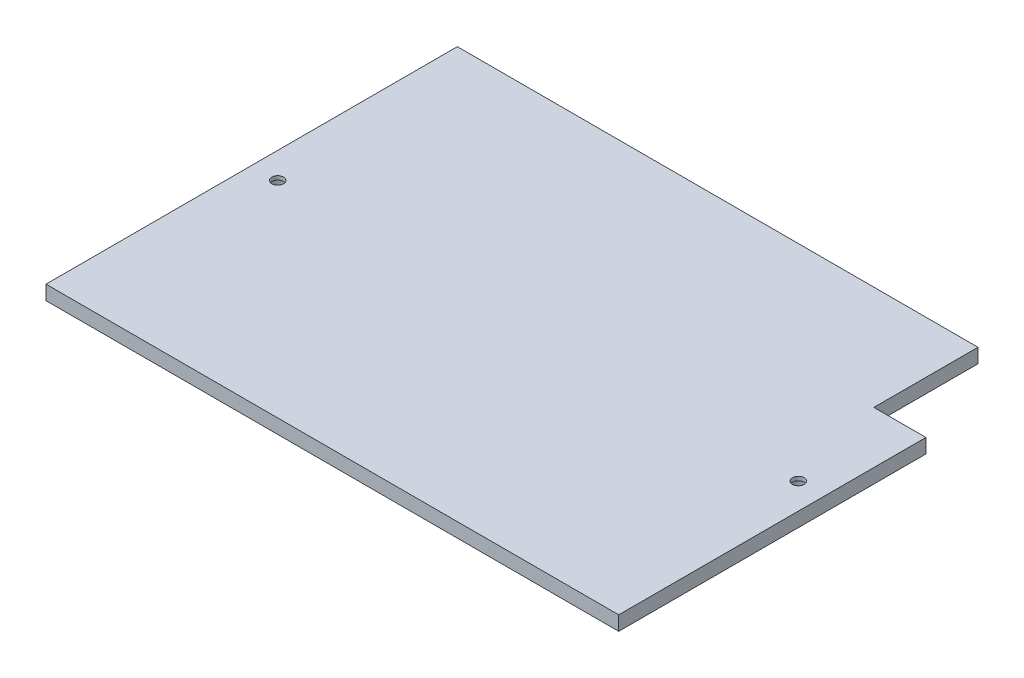
ISO-10303-21;
HEADER;
FILE_DESCRIPTION(('STEP AP214'),'2;1');
FILE_NAME('part.step','',(''),(''),'','','');
FILE_SCHEMA(('AUTOMOTIVE_DESIGN { 1 0 10303 214 1 1 1 1 }'));
ENDSEC;
DATA;
#1=APPLICATION_CONTEXT('core data for automotive mechanical design processes');
#2=APPLICATION_PROTOCOL_DEFINITION('international standard','automotive_design',2000,#1);
#3=PRODUCT_CONTEXT('',#1,'mechanical');
#4=PRODUCT('Part','Part','',(#3));
#5=PRODUCT_RELATED_PRODUCT_CATEGORY('part','',(#4));
#6=PRODUCT_DEFINITION_FORMATION('','',#4);
#7=PRODUCT_DEFINITION_CONTEXT('part definition',#1,'design');
#8=PRODUCT_DEFINITION('design','',#6,#7);
#9=PRODUCT_DEFINITION_SHAPE('','',#8);
#10=(LENGTH_UNIT() NAMED_UNIT(*) SI_UNIT(.MILLI.,.METRE.));
#11=(NAMED_UNIT(*) PLANE_ANGLE_UNIT() SI_UNIT($,.RADIAN.));
#12=(NAMED_UNIT(*) SI_UNIT($,.STERADIAN.) SOLID_ANGLE_UNIT());
#13=UNCERTAINTY_MEASURE_WITH_UNIT(LENGTH_MEASURE(1.E-05),#10,'distance_accuracy_value','');
#14=(GEOMETRIC_REPRESENTATION_CONTEXT(3) GLOBAL_UNCERTAINTY_ASSIGNED_CONTEXT((#13)) GLOBAL_UNIT_ASSIGNED_CONTEXT((#10,
#11,#12)) REPRESENTATION_CONTEXT('',''));
#15=CARTESIAN_POINT('',(0.,0.,0.));
#16=DIRECTION('',(0.,0.,1.));
#17=DIRECTION('',(1.,0.,0.));
#18=AXIS2_PLACEMENT_3D('',#15,#16,#17);
#19=CARTESIAN_POINT('',(110.,5.5,-79.));
#20=DIRECTION('',(-1.,0.,0.));
#21=DIRECTION('',(0.,0.,1.));
#22=AXIS2_PLACEMENT_3D('',#19,#20,#21);
#23=PLANE('',#22);
#24=DIRECTION('',(0.,0.,-1.));
#25=VECTOR('',#24,1.);
#26=CARTESIAN_POINT('',(110.,0.,-79.));
#27=LINE('',#26,#25);
#28=CARTESIAN_POINT('',(110.,0.,79.));
#29=VERTEX_POINT('',#28);
#30=CARTESIAN_POINT('',(110.,0.,-39.));
#31=VERTEX_POINT('',#30);
#32=EDGE_CURVE('E117',#29,#31,#27,.T.);
#33=ORIENTED_EDGE('',*,*,#32,.T.);
#34=DIRECTION('',(0.,1.,0.));
#35=VECTOR('',#34,1.);
#36=CARTESIAN_POINT('',(110.,0.,-39.));
#37=LINE('',#36,#35);
#38=CARTESIAN_POINT('',(110.,5.5,-39.));
#39=VERTEX_POINT('',#38);
#40=EDGE_CURVE('E136',#31,#39,#37,.T.);
#41=ORIENTED_EDGE('',*,*,#40,.T.);
#42=DIRECTION('',(0.,0.,-1.));
#43=VECTOR('',#42,1.);
#44=CARTESIAN_POINT('',(110.,5.5,-79.));
#45=LINE('',#44,#43);
#46=CARTESIAN_POINT('',(110.,5.5,79.));
#47=VERTEX_POINT('',#46);
#48=EDGE_CURVE('E126',#47,#39,#45,.T.);
#49=ORIENTED_EDGE('',*,*,#48,.F.);
#50=DIRECTION('',(0.,-1.,0.));
#51=VECTOR('',#50,1.);
#52=CARTESIAN_POINT('',(110.,5.5,79.));
#53=LINE('',#52,#51);
#54=EDGE_CURVE('E127',#47,#29,#53,.T.);
#55=ORIENTED_EDGE('',*,*,#54,.T.);
#56=EDGE_LOOP('',(#33,#41,#49,#55));
#57=FACE_BOUND('',#56,.T.);
#58=ADVANCED_FACE('F39',(#57),#23,.F.);
#59=CARTESIAN_POINT('',(-110.,5.5,-79.));
#60=DIRECTION('',(0.,0.,1.));
#61=DIRECTION('',(1.,0.,0.));
#62=AXIS2_PLACEMENT_3D('',#59,#60,#61);
#63=PLANE('',#62);
#64=DIRECTION('',(-1.,0.,0.));
#65=VECTOR('',#64,1.);
#66=CARTESIAN_POINT('',(-110.,5.5,-79.));
#67=LINE('',#66,#65);
#68=CARTESIAN_POINT('',(90.,5.5,-79.));
#69=VERTEX_POINT('',#68);
#70=CARTESIAN_POINT('',(-110.,5.5,-79.));
#71=VERTEX_POINT('',#70);
#72=EDGE_CURVE('E84',#69,#71,#67,.T.);
#73=ORIENTED_EDGE('',*,*,#72,.F.);
#74=DIRECTION('',(0.,1.,0.));
#75=VECTOR('',#74,1.);
#76=CARTESIAN_POINT('',(90.,0.,-79.));
#77=LINE('',#76,#75);
#78=CARTESIAN_POINT('',(90.,0.,-79.));
#79=VERTEX_POINT('',#78);
#80=EDGE_CURVE('E104',#79,#69,#77,.T.);
#81=ORIENTED_EDGE('',*,*,#80,.F.);
#82=DIRECTION('',(-1.,0.,0.));
#83=VECTOR('',#82,1.);
#84=CARTESIAN_POINT('',(-110.,0.,-79.));
#85=LINE('',#84,#83);
#86=CARTESIAN_POINT('',(-110.,0.,-79.));
#87=VERTEX_POINT('',#86);
#88=EDGE_CURVE('E112',#79,#87,#85,.T.);
#89=ORIENTED_EDGE('',*,*,#88,.T.);
#90=DIRECTION('',(0.,-1.,0.));
#91=VECTOR('',#90,1.);
#92=CARTESIAN_POINT('',(-110.,5.5,-79.));
#93=LINE('',#92,#91);
#94=EDGE_CURVE('E11',#71,#87,#93,.T.);
#95=ORIENTED_EDGE('',*,*,#94,.F.);
#96=EDGE_LOOP('',(#73,#81,#89,#95));
#97=FACE_BOUND('',#96,.T.);
#98=ADVANCED_FACE('F111',(#97),#63,.F.);
#99=CARTESIAN_POINT('',(-110.,5.5,-79.));
#100=DIRECTION('',(1.,0.,0.));
#101=DIRECTION('',(0.,0.,-1.));
#102=AXIS2_PLACEMENT_3D('',#99,#100,#101);
#103=PLANE('',#102);
#104=DIRECTION('',(0.,0.,1.));
#105=VECTOR('',#104,1.);
#106=CARTESIAN_POINT('',(-110.,0.,-79.));
#107=LINE('',#106,#105);
#108=CARTESIAN_POINT('',(-110.,0.,79.));
#109=VERTEX_POINT('',#108);
#110=EDGE_CURVE('E116',#87,#109,#107,.T.);
#111=ORIENTED_EDGE('',*,*,#110,.T.);
#112=DIRECTION('',(0.,-1.,0.));
#113=VECTOR('',#112,1.);
#114=CARTESIAN_POINT('',(-110.,5.5,79.));
#115=LINE('',#114,#113);
#116=CARTESIAN_POINT('',(-110.,5.5,79.));
#117=VERTEX_POINT('',#116);
#118=EDGE_CURVE('E46',#117,#109,#115,.T.);
#119=ORIENTED_EDGE('',*,*,#118,.F.);
#120=DIRECTION('',(0.,0.,1.));
#121=VECTOR('',#120,1.);
#122=CARTESIAN_POINT('',(-110.,5.5,-79.));
#123=LINE('',#122,#121);
#124=EDGE_CURVE('E139',#71,#117,#123,.T.);
#125=ORIENTED_EDGE('',*,*,#124,.F.);
#126=ORIENTED_EDGE('',*,*,#94,.T.);
#127=EDGE_LOOP('',(#111,#119,#125,#126));
#128=FACE_BOUND('',#127,.T.);
#129=ADVANCED_FACE('F146',(#128),#103,.F.);
#130=CARTESIAN_POINT('',(-110.,5.5,79.));
#131=DIRECTION('',(0.,0.,-1.));
#132=DIRECTION('',(-1.,0.,0.));
#133=AXIS2_PLACEMENT_3D('',#130,#131,#132);
#134=PLANE('',#133);
#135=DIRECTION('',(1.,0.,0.));
#136=VECTOR('',#135,1.);
#137=CARTESIAN_POINT('',(-110.,0.,79.));
#138=LINE('',#137,#136);
#139=EDGE_CURVE('E79',#109,#29,#138,.T.);
#140=ORIENTED_EDGE('',*,*,#139,.T.);
#141=ORIENTED_EDGE('',*,*,#54,.F.);
#142=DIRECTION('',(1.,0.,0.));
#143=VECTOR('',#142,1.);
#144=CARTESIAN_POINT('',(-110.,5.5,79.));
#145=LINE('',#144,#143);
#146=EDGE_CURVE('E62',#117,#47,#145,.T.);
#147=ORIENTED_EDGE('',*,*,#146,.F.);
#148=ORIENTED_EDGE('',*,*,#118,.T.);
#149=EDGE_LOOP('',(#140,#141,#147,#148));
#150=FACE_BOUND('',#149,.T.);
#151=ADVANCED_FACE('F129',(#150),#134,.F.);
#152=CARTESIAN_POINT('',(0.,5.5,0.));
#153=DIRECTION('',(0.,1.,0.));
#154=DIRECTION('',(0.,0.,1.));
#155=AXIS2_PLACEMENT_3D('',#152,#153,#154);
#156=PLANE('',#155);
#157=DIRECTION('',(1.,0.,0.));
#158=VECTOR('',#157,1.);
#159=CARTESIAN_POINT('',(110.,5.5,-39.));
#160=LINE('',#159,#158);
#161=CARTESIAN_POINT('',(90.,5.5,-39.));
#162=VERTEX_POINT('',#161);
#163=EDGE_CURVE('E108',#162,#39,#160,.T.);
#164=ORIENTED_EDGE('',*,*,#163,.F.);
#165=DIRECTION('',(0.,0.,1.));
#166=VECTOR('',#165,1.);
#167=CARTESIAN_POINT('',(90.,5.5,-79.));
#168=LINE('',#167,#166);
#169=EDGE_CURVE('E299',#69,#162,#168,.T.);
#170=ORIENTED_EDGE('',*,*,#169,.F.);
#171=ORIENTED_EDGE('',*,*,#72,.T.);
#172=ORIENTED_EDGE('',*,*,#124,.T.);
#173=ORIENTED_EDGE('',*,*,#146,.T.);
#174=ORIENTED_EDGE('',*,*,#48,.T.);
#175=EDGE_LOOP('',(#164,#170,#171,#172,#173,#174));
#176=FACE_BOUND('',#175,.T.);
#177=CARTESIAN_POINT('',(-100.,5.5,0.));
#178=DIRECTION('',(0.,-1.,0.));
#179=DIRECTION('',(0.,0.,-1.));
#180=AXIS2_PLACEMENT_3D('',#177,#178,#179);
#181=CIRCLE('',#180,2.25);
#182=CARTESIAN_POINT('',(-100.,5.5,-2.25));
#183=VERTEX_POINT('',#182);
#184=EDGE_CURVE('E284',#183,#183,#181,.T.);
#185=ORIENTED_EDGE('',*,*,#184,.T.);
#186=EDGE_LOOP('',(#185));
#187=FACE_BOUND('',#186,.T.);
#188=CARTESIAN_POINT('',(100.,5.5,0.));
#189=DIRECTION('',(0.,-1.,0.));
#190=DIRECTION('',(0.,0.,-1.));
#191=AXIS2_PLACEMENT_3D('',#188,#189,#190);
#192=CIRCLE('',#191,2.25);
#193=CARTESIAN_POINT('',(100.,5.5,-2.25));
#194=VERTEX_POINT('',#193);
#195=EDGE_CURVE('E121',#194,#194,#192,.T.);
#196=ORIENTED_EDGE('',*,*,#195,.T.);
#197=EDGE_LOOP('',(#196));
#198=FACE_BOUND('',#197,.T.);
#199=ADVANCED_FACE('F144',(#176,#187,#198),#156,.T.);
#200=CARTESIAN_POINT('',(0.,0.,0.));
#201=DIRECTION('',(0.,1.,0.));
#202=DIRECTION('',(0.,0.,1.));
#203=AXIS2_PLACEMENT_3D('',#200,#201,#202);
#204=PLANE('',#203);
#205=CARTESIAN_POINT('',(-100.,0.,0.));
#206=DIRECTION('',(0.,-1.,0.));
#207=DIRECTION('',(0.,0.,-1.));
#208=AXIS2_PLACEMENT_3D('',#205,#206,#207);
#209=CIRCLE('',#208,3.99999999999999);
#210=CARTESIAN_POINT('',(-100.,0.,-3.99999999999999));
#211=VERTEX_POINT('',#210);
#212=EDGE_CURVE('E293',#211,#211,#209,.T.);
#213=ORIENTED_EDGE('',*,*,#212,.F.);
#214=EDGE_LOOP('',(#213));
#215=FACE_BOUND('',#214,.T.);
#216=CARTESIAN_POINT('',(100.,0.,0.));
#217=DIRECTION('',(0.,-1.,0.));
#218=DIRECTION('',(0.,0.,-1.));
#219=AXIS2_PLACEMENT_3D('',#216,#217,#218);
#220=CIRCLE('',#219,3.99999999999999);
#221=CARTESIAN_POINT('',(100.,0.,-3.99999999999999));
#222=VERTEX_POINT('',#221);
#223=EDGE_CURVE('E279',#222,#222,#220,.T.);
#224=ORIENTED_EDGE('',*,*,#223,.F.);
#225=EDGE_LOOP('',(#224));
#226=FACE_BOUND('',#225,.T.);
#227=DIRECTION('',(0.,0.,1.));
#228=VECTOR('',#227,1.);
#229=CARTESIAN_POINT('',(90.,0.,-79.));
#230=LINE('',#229,#228);
#231=CARTESIAN_POINT('',(90.,0.,-39.));
#232=VERTEX_POINT('',#231);
#233=EDGE_CURVE('E100',#79,#232,#230,.T.);
#234=ORIENTED_EDGE('',*,*,#233,.T.);
#235=DIRECTION('',(1.,0.,0.));
#236=VECTOR('',#235,1.);
#237=CARTESIAN_POINT('',(110.,0.,-39.));
#238=LINE('',#237,#236);
#239=EDGE_CURVE('E53',#232,#31,#238,.T.);
#240=ORIENTED_EDGE('',*,*,#239,.T.);
#241=ORIENTED_EDGE('',*,*,#32,.F.);
#242=ORIENTED_EDGE('',*,*,#139,.F.);
#243=ORIENTED_EDGE('',*,*,#110,.F.);
#244=ORIENTED_EDGE('',*,*,#88,.F.);
#245=EDGE_LOOP('',(#234,#240,#241,#242,#243,#244));
#246=FACE_BOUND('',#245,.T.);
#247=ADVANCED_FACE('F115',(#215,#226,#246),#204,.F.);
#248=CARTESIAN_POINT('',(100.,0.,0.));
#249=DIRECTION('',(0.,-1.,0.));
#250=DIRECTION('',(0.,0.,-1.));
#251=AXIS2_PLACEMENT_3D('',#248,#249,#250);
#252=CYLINDRICAL_SURFACE('',#251,2.25);
#253=ORIENTED_EDGE('',*,*,#195,.F.);
#254=EDGE_LOOP('',(#253));
#255=FACE_BOUND('',#254,.T.);
#256=CARTESIAN_POINT('',(100.,4.,0.));
#257=DIRECTION('',(0.,-1.,0.));
#258=DIRECTION('',(0.,0.,-1.));
#259=AXIS2_PLACEMENT_3D('',#256,#257,#258);
#260=CIRCLE('',#259,2.25);
#261=CARTESIAN_POINT('',(100.,4.,-2.25));
#262=VERTEX_POINT('',#261);
#263=EDGE_CURVE('E276',#262,#262,#260,.T.);
#264=ORIENTED_EDGE('',*,*,#263,.T.);
#265=EDGE_LOOP('',(#264));
#266=FACE_BOUND('',#265,.T.);
#267=ADVANCED_FACE('F182',(#255,#266),#252,.F.);
#268=CARTESIAN_POINT('',(102.25,4.,0.));
#269=DIRECTION('',(0.,1.,0.));
#270=DIRECTION('',(0.,0.,1.));
#271=AXIS2_PLACEMENT_3D('',#268,#269,#270);
#272=PLANE('',#271);
#273=ORIENTED_EDGE('',*,*,#263,.F.);
#274=EDGE_LOOP('',(#273));
#275=FACE_BOUND('',#274,.T.);
#276=CARTESIAN_POINT('',(100.,4.,0.));
#277=DIRECTION('',(0.,-1.,0.));
#278=DIRECTION('',(0.,0.,-1.));
#279=AXIS2_PLACEMENT_3D('',#276,#277,#278);
#280=CIRCLE('',#279,4.);
#281=CARTESIAN_POINT('',(100.,4.,-4.));
#282=VERTEX_POINT('',#281);
#283=EDGE_CURVE('E277',#282,#282,#280,.T.);
#284=ORIENTED_EDGE('',*,*,#283,.T.);
#285=EDGE_LOOP('',(#284));
#286=FACE_BOUND('',#285,.T.);
#287=ADVANCED_FACE('F234',(#275,#286),#272,.F.);
#288=CARTESIAN_POINT('',(100.,0.,0.));
#289=DIRECTION('',(0.,-1.,0.));
#290=DIRECTION('',(0.,0.,-1.));
#291=AXIS2_PLACEMENT_3D('',#288,#289,#290);
#292=CYLINDRICAL_SURFACE('',#291,4.);
#293=ORIENTED_EDGE('',*,*,#283,.F.);
#294=EDGE_LOOP('',(#293));
#295=FACE_BOUND('',#294,.T.);
#296=ORIENTED_EDGE('',*,*,#223,.T.);
#297=EDGE_LOOP('',(#296));
#298=FACE_BOUND('',#297,.T.);
#299=ADVANCED_FACE('F225',(#295,#298),#292,.F.);
#300=CARTESIAN_POINT('',(-100.,0.,0.));
#301=DIRECTION('',(0.,-1.,0.));
#302=DIRECTION('',(0.,0.,-1.));
#303=AXIS2_PLACEMENT_3D('',#300,#301,#302);
#304=CYLINDRICAL_SURFACE('',#303,2.25);
#305=ORIENTED_EDGE('',*,*,#184,.F.);
#306=EDGE_LOOP('',(#305));
#307=FACE_BOUND('',#306,.T.);
#308=CARTESIAN_POINT('',(-100.,4.,0.));
#309=DIRECTION('',(0.,-1.,0.));
#310=DIRECTION('',(0.,0.,-1.));
#311=AXIS2_PLACEMENT_3D('',#308,#309,#310);
#312=CIRCLE('',#311,2.25);
#313=CARTESIAN_POINT('',(-100.,4.,-2.25));
#314=VERTEX_POINT('',#313);
#315=EDGE_CURVE('E287',#314,#314,#312,.T.);
#316=ORIENTED_EDGE('',*,*,#315,.T.);
#317=EDGE_LOOP('',(#316));
#318=FACE_BOUND('',#317,.T.);
#319=ADVANCED_FACE('F216',(#307,#318),#304,.F.);
#320=CARTESIAN_POINT('',(-97.75,4.,0.));
#321=DIRECTION('',(0.,1.,0.));
#322=DIRECTION('',(0.,0.,1.));
#323=AXIS2_PLACEMENT_3D('',#320,#321,#322);
#324=PLANE('',#323);
#325=ORIENTED_EDGE('',*,*,#315,.F.);
#326=EDGE_LOOP('',(#325));
#327=FACE_BOUND('',#326,.T.);
#328=CARTESIAN_POINT('',(-100.,4.,0.));
#329=DIRECTION('',(0.,-1.,0.));
#330=DIRECTION('',(0.,0.,-1.));
#331=AXIS2_PLACEMENT_3D('',#328,#329,#330);
#332=CIRCLE('',#331,4.);
#333=CARTESIAN_POINT('',(-100.,4.,-4.));
#334=VERTEX_POINT('',#333);
#335=EDGE_CURVE('E290',#334,#334,#332,.T.);
#336=ORIENTED_EDGE('',*,*,#335,.T.);
#337=EDGE_LOOP('',(#336));
#338=FACE_BOUND('',#337,.T.);
#339=ADVANCED_FACE('F208',(#327,#338),#324,.F.);
#340=CARTESIAN_POINT('',(-100.,0.,0.));
#341=DIRECTION('',(0.,-1.,0.));
#342=DIRECTION('',(0.,0.,-1.));
#343=AXIS2_PLACEMENT_3D('',#340,#341,#342);
#344=CYLINDRICAL_SURFACE('',#343,4.);
#345=ORIENTED_EDGE('',*,*,#335,.F.);
#346=EDGE_LOOP('',(#345));
#347=FACE_BOUND('',#346,.T.);
#348=ORIENTED_EDGE('',*,*,#212,.T.);
#349=EDGE_LOOP('',(#348));
#350=FACE_BOUND('',#349,.T.);
#351=ADVANCED_FACE('F162',(#347,#350),#344,.F.);
#352=CARTESIAN_POINT('',(110.,0.,-39.));
#353=DIRECTION('',(0.,0.,1.));
#354=DIRECTION('',(1.,0.,0.));
#355=AXIS2_PLACEMENT_3D('',#352,#353,#354);
#356=PLANE('',#355);
#357=ORIENTED_EDGE('',*,*,#163,.T.);
#358=ORIENTED_EDGE('',*,*,#40,.F.);
#359=ORIENTED_EDGE('',*,*,#239,.F.);
#360=DIRECTION('',(0.,1.,0.));
#361=VECTOR('',#360,1.);
#362=CARTESIAN_POINT('',(90.,0.,-39.));
#363=LINE('',#362,#361);
#364=EDGE_CURVE('E105',#232,#162,#363,.T.);
#365=ORIENTED_EDGE('',*,*,#364,.T.);
#366=EDGE_LOOP('',(#357,#358,#359,#365));
#367=FACE_BOUND('',#366,.T.);
#368=ADVANCED_FACE('F189',(#367),#356,.F.);
#369=CARTESIAN_POINT('',(90.,0.,-79.));
#370=DIRECTION('',(-1.,0.,0.));
#371=DIRECTION('',(0.,0.,1.));
#372=AXIS2_PLACEMENT_3D('',#369,#370,#371);
#373=PLANE('',#372);
#374=ORIENTED_EDGE('',*,*,#169,.T.);
#375=ORIENTED_EDGE('',*,*,#364,.F.);
#376=ORIENTED_EDGE('',*,*,#233,.F.);
#377=ORIENTED_EDGE('',*,*,#80,.T.);
#378=EDGE_LOOP('',(#374,#375,#376,#377));
#379=FACE_BOUND('',#378,.T.);
#380=ADVANCED_FACE('F103',(#379),#373,.F.);
#381=CLOSED_SHELL('',(#58,#98,#129,#151,#199,#247,#267,#287,#299,#319,#339,#351,#368,#380));
#382=MANIFOLD_SOLID_BREP('B2',#381);
#383=ADVANCED_BREP_SHAPE_REPRESENTATION('',(#18,#382),#14);
#384=SHAPE_DEFINITION_REPRESENTATION(#9,#383);
ENDSEC;
END-ISO-10303-21;
